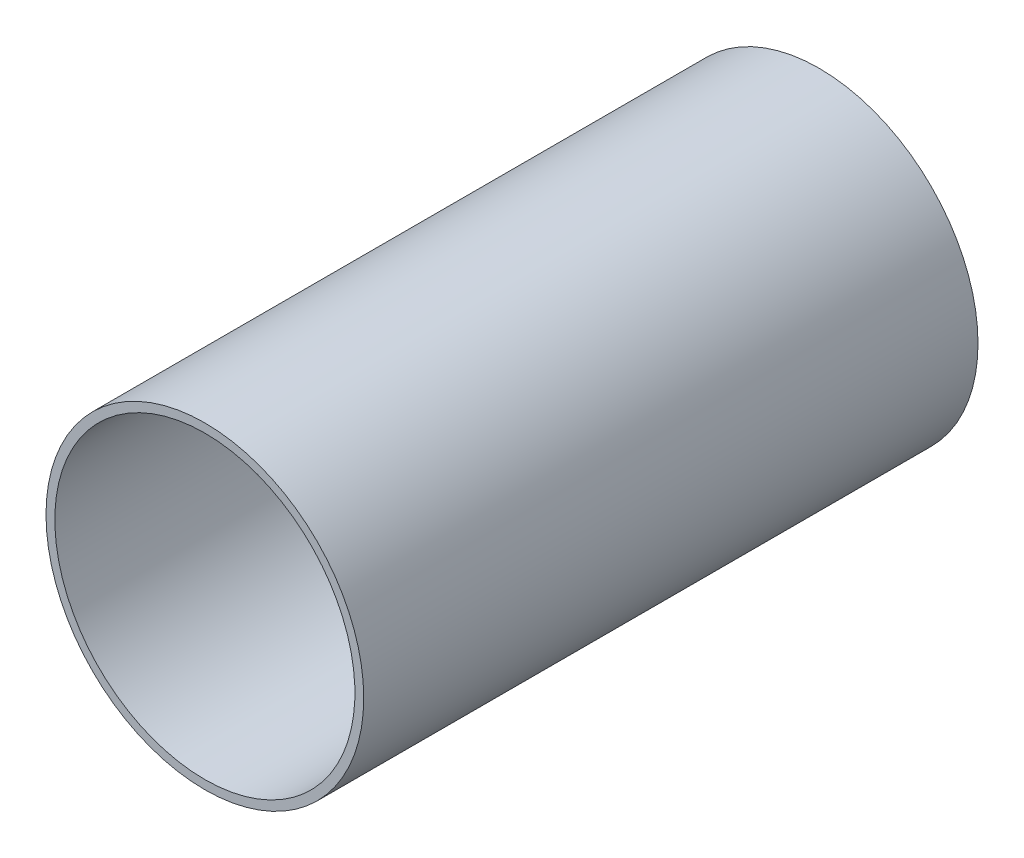
ISO-10303-21;
HEADER;
FILE_DESCRIPTION(('STEP AP214'),'2;1');
FILE_NAME('part.step','',(''),(''),'','','');
FILE_SCHEMA(('AUTOMOTIVE_DESIGN { 1 0 10303 214 1 1 1 1 }'));
ENDSEC;
DATA;
#1=APPLICATION_CONTEXT('core data for automotive mechanical design processes');
#2=APPLICATION_PROTOCOL_DEFINITION('international standard','automotive_design',2000,#1);
#3=PRODUCT_CONTEXT('',#1,'mechanical');
#4=PRODUCT('Part','Part','',(#3));
#5=PRODUCT_RELATED_PRODUCT_CATEGORY('part','',(#4));
#6=PRODUCT_DEFINITION_FORMATION('','',#4);
#7=PRODUCT_DEFINITION_CONTEXT('part definition',#1,'design');
#8=PRODUCT_DEFINITION('design','',#6,#7);
#9=PRODUCT_DEFINITION_SHAPE('','',#8);
#10=(LENGTH_UNIT() NAMED_UNIT(*) SI_UNIT(.MILLI.,.METRE.));
#11=(NAMED_UNIT(*) PLANE_ANGLE_UNIT() SI_UNIT($,.RADIAN.));
#12=(NAMED_UNIT(*) SI_UNIT($,.STERADIAN.) SOLID_ANGLE_UNIT());
#13=UNCERTAINTY_MEASURE_WITH_UNIT(LENGTH_MEASURE(1.E-05),#10,'distance_accuracy_value','');
#14=(GEOMETRIC_REPRESENTATION_CONTEXT(3) GLOBAL_UNCERTAINTY_ASSIGNED_CONTEXT((#13)) GLOBAL_UNIT_ASSIGNED_CONTEXT((#10,
#11,#12)) REPRESENTATION_CONTEXT('',''));
#15=CARTESIAN_POINT('',(0.,0.,0.));
#16=DIRECTION('',(0.,0.,1.));
#17=DIRECTION('',(1.,0.,0.));
#18=AXIS2_PLACEMENT_3D('',#15,#16,#17);
#19=CARTESIAN_POINT('',(120.645,-153.249,-0.045));
#20=DIRECTION('',(0.,0.,-1.));
#21=DIRECTION('',(0.,-1.,0.));
#22=AXIS2_PLACEMENT_3D('',#19,#20,#21);
#23=CYLINDRICAL_SURFACE('',#22,0.425);
#24=CARTESIAN_POINT('',(120.645,-153.249,-0.035));
#25=DIRECTION('',(0.,0.,-1.));
#26=DIRECTION('',(0.,-1.,0.));
#27=AXIS2_PLACEMENT_3D('',#24,#25,#26);
#28=CIRCLE('',#27,0.425);
#29=CARTESIAN_POINT('',(120.645,-153.674,-0.035));
#30=VERTEX_POINT('',#29);
#31=EDGE_CURVE('E64',#30,#30,#28,.T.);
#32=ORIENTED_EDGE('',*,*,#31,.T.);
#33=DIRECTION('',(0.,0.,1.));
#34=VECTOR('',#33,1.);
#35=CARTESIAN_POINT('',(120.645,-153.674,-0.045));
#36=LINE('',#35,#34);
#37=CARTESIAN_POINT('',(120.645,-153.674,1.705));
#38=VERTEX_POINT('',#37);
#39=EDGE_CURVE('E11',#30,#38,#36,.T.);
#40=ORIENTED_EDGE('',*,*,#39,.T.);
#41=CARTESIAN_POINT('',(120.645,-153.249,1.705));
#42=DIRECTION('',(0.,0.,-1.));
#43=DIRECTION('',(0.,-1.,0.));
#44=AXIS2_PLACEMENT_3D('',#41,#42,#43);
#45=CIRCLE('',#44,0.425);
#46=EDGE_CURVE('E25',#38,#38,#45,.T.);
#47=ORIENTED_EDGE('',*,*,#46,.F.);
#48=ORIENTED_EDGE('',*,*,#39,.F.);
#49=EDGE_LOOP('',(#32,#40,#47,#48));
#50=FACE_BOUND('',#49,.T.);
#51=ADVANCED_FACE('F17',(#50),#23,.F.);
#52=CARTESIAN_POINT('',(120.645,-153.699,1.705));
#53=DIRECTION('',(0.,0.,1.));
#54=DIRECTION('',(1.,0.,0.));
#55=AXIS2_PLACEMENT_3D('',#52,#53,#54);
#56=PLANE('',#55);
#57=ORIENTED_EDGE('',*,*,#46,.T.);
#58=EDGE_LOOP('',(#57));
#59=FACE_BOUND('',#58,.T.);
#60=CARTESIAN_POINT('',(120.645,-153.249,1.705));
#61=DIRECTION('',(0.,0.,1.));
#62=DIRECTION('',(0.,-1.,0.));
#63=AXIS2_PLACEMENT_3D('',#60,#61,#62);
#64=CIRCLE('',#63,0.45);
#65=CARTESIAN_POINT('',(120.645,-153.699,1.705));
#66=VERTEX_POINT('',#65);
#67=EDGE_CURVE('E56',#66,#66,#64,.T.);
#68=ORIENTED_EDGE('',*,*,#67,.T.);
#69=EDGE_LOOP('',(#68));
#70=FACE_BOUND('',#69,.T.);
#71=ADVANCED_FACE('F80',(#59,#70),#56,.T.);
#72=CARTESIAN_POINT('',(120.645,-153.699,-0.035));
#73=DIRECTION('',(0.,0.,1.));
#74=DIRECTION('',(1.,0.,0.));
#75=AXIS2_PLACEMENT_3D('',#72,#73,#74);
#76=PLANE('',#75);
#77=ORIENTED_EDGE('',*,*,#31,.F.);
#78=EDGE_LOOP('',(#77));
#79=FACE_BOUND('',#78,.T.);
#80=CARTESIAN_POINT('',(120.645,-153.249,-0.035));
#81=DIRECTION('',(0.,0.,1.));
#82=DIRECTION('',(0.,-1.,0.));
#83=AXIS2_PLACEMENT_3D('',#80,#81,#82);
#84=CIRCLE('',#83,0.45);
#85=CARTESIAN_POINT('',(120.645,-153.699,-0.035));
#86=VERTEX_POINT('',#85);
#87=EDGE_CURVE('E55',#86,#86,#84,.T.);
#88=ORIENTED_EDGE('',*,*,#87,.F.);
#89=EDGE_LOOP('',(#88));
#90=FACE_BOUND('',#89,.T.);
#91=ADVANCED_FACE('F77',(#79,#90),#76,.F.);
#92=CARTESIAN_POINT('',(120.645,-153.249,-0.035));
#93=DIRECTION('',(0.,0.,-1.));
#94=DIRECTION('',(0.,-1.,0.));
#95=AXIS2_PLACEMENT_3D('',#92,#93,#94);
#96=CYLINDRICAL_SURFACE('',#95,0.45);
#97=ORIENTED_EDGE('',*,*,#87,.T.);
#98=DIRECTION('',(0.,0.,1.));
#99=VECTOR('',#98,1.);
#100=CARTESIAN_POINT('',(120.645,-153.699,-0.035));
#101=LINE('',#100,#99);
#102=EDGE_CURVE('E52',#86,#66,#101,.T.);
#103=ORIENTED_EDGE('',*,*,#102,.T.);
#104=ORIENTED_EDGE('',*,*,#67,.F.);
#105=ORIENTED_EDGE('',*,*,#102,.F.);
#106=EDGE_LOOP('',(#97,#103,#104,#105));
#107=FACE_BOUND('',#106,.T.);
#108=ADVANCED_FACE('F53',(#107),#96,.T.);
#109=CLOSED_SHELL('',(#51,#71,#91,#108));
#110=MANIFOLD_SOLID_BREP('B1',#109);
#111=ADVANCED_BREP_SHAPE_REPRESENTATION('',(#18,#110),#14);
#112=SHAPE_DEFINITION_REPRESENTATION(#9,#111);
ENDSEC;
END-ISO-10303-21;
